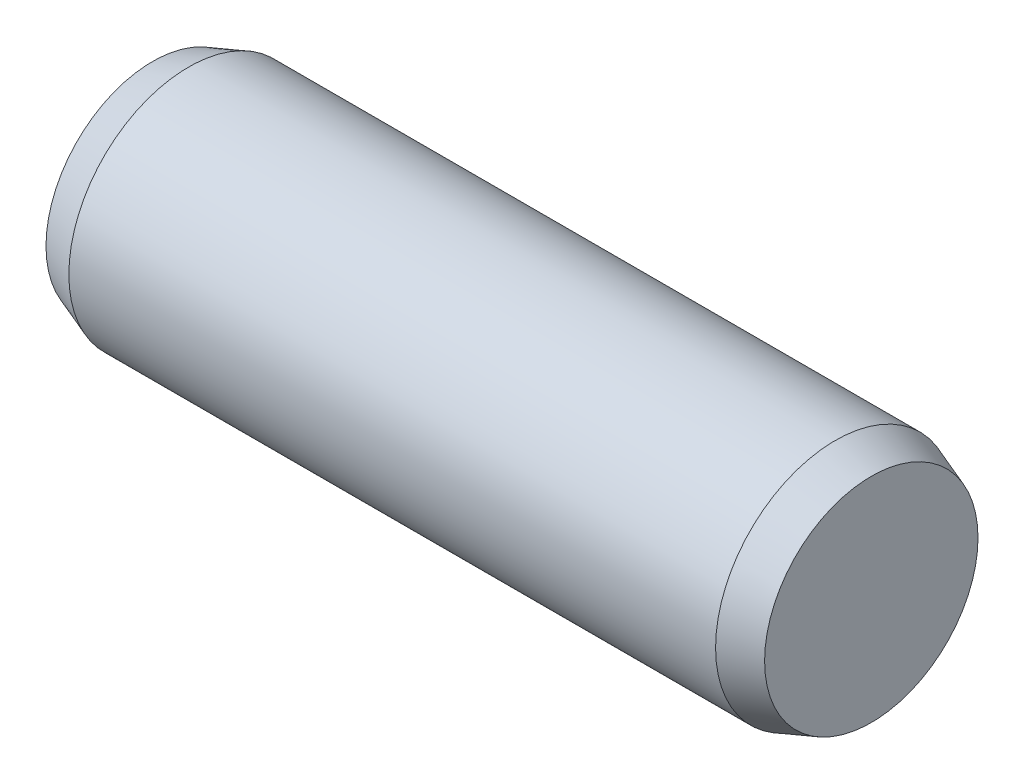
ISO-10303-21;
HEADER;
FILE_DESCRIPTION(('STEP AP214'),'2;1');
FILE_NAME('part.step','',(''),(''),'','','');
FILE_SCHEMA(('AUTOMOTIVE_DESIGN { 1 0 10303 214 1 1 1 1 }'));
ENDSEC;
DATA;
#1=APPLICATION_CONTEXT('core data for automotive mechanical design processes');
#2=APPLICATION_PROTOCOL_DEFINITION('international standard','automotive_design',2000,#1);
#3=PRODUCT_CONTEXT('',#1,'mechanical');
#4=PRODUCT('Part','Part','',(#3));
#5=PRODUCT_RELATED_PRODUCT_CATEGORY('part','',(#4));
#6=PRODUCT_DEFINITION_FORMATION('','',#4);
#7=PRODUCT_DEFINITION_CONTEXT('part definition',#1,'design');
#8=PRODUCT_DEFINITION('design','',#6,#7);
#9=PRODUCT_DEFINITION_SHAPE('','',#8);
#10=(LENGTH_UNIT() NAMED_UNIT(*) SI_UNIT(.MILLI.,.METRE.));
#11=(NAMED_UNIT(*) PLANE_ANGLE_UNIT() SI_UNIT($,.RADIAN.));
#12=(NAMED_UNIT(*) SI_UNIT($,.STERADIAN.) SOLID_ANGLE_UNIT());
#13=UNCERTAINTY_MEASURE_WITH_UNIT(LENGTH_MEASURE(1.E-05),#10,'distance_accuracy_value','');
#14=(GEOMETRIC_REPRESENTATION_CONTEXT(3) GLOBAL_UNCERTAINTY_ASSIGNED_CONTEXT((#13)) GLOBAL_UNIT_ASSIGNED_CONTEXT((#10,
#11,#12)) REPRESENTATION_CONTEXT('',''));
#15=CARTESIAN_POINT('',(0.,0.,0.));
#16=DIRECTION('',(0.,0.,1.));
#17=DIRECTION('',(1.,0.,0.));
#18=AXIS2_PLACEMENT_3D('',#15,#16,#17);
#19=CARTESIAN_POINT('',(3.,0.,0.));
#20=DIRECTION('',(1.,0.,0.));
#21=DIRECTION('',(0.,0.,-1.));
#22=AXIS2_PLACEMENT_3D('',#19,#20,#21);
#23=PLANE('',#22);
#24=CARTESIAN_POINT('',(3.00000000004275,0.,0.));
#25=DIRECTION('',(-1.,0.,0.));
#26=DIRECTION('',(0.,0.,1.));
#27=AXIS2_PLACEMENT_3D('',#24,#25,#26);
#28=CIRCLE('',#27,0.890908929733314);
#29=CARTESIAN_POINT('',(3.00000000004275,0.,0.890908929733314));
#30=VERTEX_POINT('',#29);
#31=EDGE_CURVE('E17',#30,#30,#28,.T.);
#32=ORIENTED_EDGE('',*,*,#31,.F.);
#33=EDGE_LOOP('',(#32));
#34=FACE_BOUND('',#33,.T.);
#35=ADVANCED_FACE('F14',(#34),#23,.T.);
#36=CARTESIAN_POINT('',(-3.,0.,0.));
#37=DIRECTION('',(1.,0.,0.));
#38=DIRECTION('',(0.,0.,-1.));
#39=AXIS2_PLACEMENT_3D('',#36,#37,#38);
#40=PLANE('',#39);
#41=CARTESIAN_POINT('',(-2.9999999999859,0.,0.));
#42=DIRECTION('',(1.,0.,0.));
#43=DIRECTION('',(0.,0.,-1.));
#44=AXIS2_PLACEMENT_3D('',#41,#42,#43);
#45=CIRCLE('',#44,0.890908929733314);
#46=CARTESIAN_POINT('',(-2.9999999999859,0.,-0.890908929733314));
#47=VERTEX_POINT('',#46);
#48=EDGE_CURVE('E26',#47,#47,#45,.T.);
#49=ORIENTED_EDGE('',*,*,#48,.F.);
#50=EDGE_LOOP('',(#49));
#51=FACE_BOUND('',#50,.T.);
#52=ADVANCED_FACE('F37',(#51),#40,.F.);
#53=CARTESIAN_POINT('',(2.69999999989068,0.,0.));
#54=DIRECTION('',(-1.,0.,0.));
#55=DIRECTION('',(0.,0.,1.));
#56=AXIS2_PLACEMENT_3D('',#53,#54,#55);
#57=CONICAL_SURFACE('',#56,1.00010000005568,0.349065850361069);
#58=CARTESIAN_POINT('',(2.7,0.,0.));
#59=DIRECTION('',(-1.,0.,0.));
#60=DIRECTION('',(0.,0.,1.));
#61=AXIS2_PLACEMENT_3D('',#58,#59,#60);
#62=CIRCLE('',#61,1.0001);
#63=CARTESIAN_POINT('',(2.7,0.,1.0001));
#64=VERTEX_POINT('',#63);
#65=EDGE_CURVE('E21',#64,#64,#62,.T.);
#66=ORIENTED_EDGE('',*,*,#65,.F.);
#67=EDGE_LOOP('',(#66));
#68=FACE_BOUND('',#67,.T.);
#69=ORIENTED_EDGE('',*,*,#31,.T.);
#70=EDGE_LOOP('',(#69));
#71=FACE_BOUND('',#70,.T.);
#72=ADVANCED_FACE('F34',(#68,#71),#57,.T.);
#73=CARTESIAN_POINT('',(-2.70000000006121,0.,0.));
#74=DIRECTION('',(1.,0.,0.));
#75=DIRECTION('',(0.,0.,-1.));
#76=AXIS2_PLACEMENT_3D('',#73,#74,#75);
#77=CONICAL_SURFACE('',#76,1.00009999997042,0.349065850353687);
#78=CARTESIAN_POINT('',(-2.7,0.,0.));
#79=DIRECTION('',(-1.,0.,0.));
#80=DIRECTION('',(0.,0.,1.));
#81=AXIS2_PLACEMENT_3D('',#78,#79,#80);
#82=CIRCLE('',#81,1.0001);
#83=CARTESIAN_POINT('',(-2.7,0.,1.0001));
#84=VERTEX_POINT('',#83);
#85=EDGE_CURVE('E10',#84,#84,#82,.F.);
#86=ORIENTED_EDGE('',*,*,#85,.F.);
#87=EDGE_LOOP('',(#86));
#88=FACE_BOUND('',#87,.T.);
#89=ORIENTED_EDGE('',*,*,#48,.T.);
#90=EDGE_LOOP('',(#89));
#91=FACE_BOUND('',#90,.T.);
#92=ADVANCED_FACE('F45',(#88,#91),#77,.T.);
#93=CARTESIAN_POINT('',(3.,0.,0.));
#94=DIRECTION('',(-1.,0.,0.));
#95=DIRECTION('',(0.,0.,1.));
#96=AXIS2_PLACEMENT_3D('',#93,#94,#95);
#97=CYLINDRICAL_SURFACE('',#96,1.0001);
#98=ORIENTED_EDGE('',*,*,#85,.T.);
#99=EDGE_LOOP('',(#98));
#100=FACE_BOUND('',#99,.T.);
#101=ORIENTED_EDGE('',*,*,#65,.T.);
#102=EDGE_LOOP('',(#101));
#103=FACE_BOUND('',#102,.T.);
#104=ADVANCED_FACE('F43',(#100,#103),#97,.T.);
#105=CLOSED_SHELL('',(#35,#52,#72,#92,#104));
#106=MANIFOLD_SOLID_BREP('B1',#105);
#107=ADVANCED_BREP_SHAPE_REPRESENTATION('',(#18,#106),#14);
#108=SHAPE_DEFINITION_REPRESENTATION(#9,#107);
ENDSEC;
END-ISO-10303-21;
